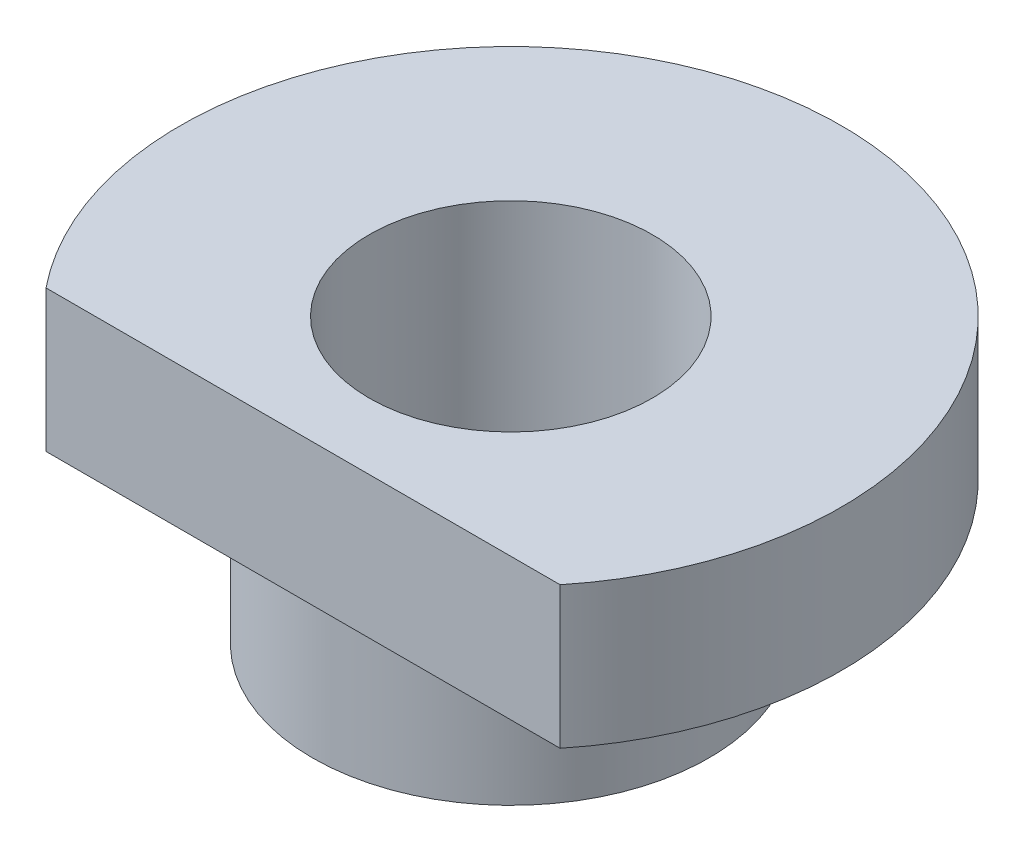
ISO-10303-21;
HEADER;
FILE_DESCRIPTION(('STEP AP214'),'2;1');
FILE_NAME('part.step','',(''),(''),'','','');
FILE_SCHEMA(('AUTOMOTIVE_DESIGN { 1 0 10303 214 1 1 1 1 }'));
ENDSEC;
DATA;
#1=APPLICATION_CONTEXT('core data for automotive mechanical design processes');
#2=APPLICATION_PROTOCOL_DEFINITION('international standard','automotive_design',2000,#1);
#3=PRODUCT_CONTEXT('',#1,'mechanical');
#4=PRODUCT('Part','Part','',(#3));
#5=PRODUCT_RELATED_PRODUCT_CATEGORY('part','',(#4));
#6=PRODUCT_DEFINITION_FORMATION('','',#4);
#7=PRODUCT_DEFINITION_CONTEXT('part definition',#1,'design');
#8=PRODUCT_DEFINITION('design','',#6,#7);
#9=PRODUCT_DEFINITION_SHAPE('','',#8);
#10=(LENGTH_UNIT() NAMED_UNIT(*) SI_UNIT(.MILLI.,.METRE.));
#11=(NAMED_UNIT(*) PLANE_ANGLE_UNIT() SI_UNIT($,.RADIAN.));
#12=(NAMED_UNIT(*) SI_UNIT($,.STERADIAN.) SOLID_ANGLE_UNIT());
#13=UNCERTAINTY_MEASURE_WITH_UNIT(LENGTH_MEASURE(1.E-05),#10,'distance_accuracy_value','');
#14=(GEOMETRIC_REPRESENTATION_CONTEXT(3) GLOBAL_UNCERTAINTY_ASSIGNED_CONTEXT((#13)) GLOBAL_UNIT_ASSIGNED_CONTEXT((#10,
#11,#12)) REPRESENTATION_CONTEXT('',''));
#15=CARTESIAN_POINT('',(0.,0.,0.));
#16=DIRECTION('',(0.,0.,1.));
#17=DIRECTION('',(1.,0.,0.));
#18=AXIS2_PLACEMENT_3D('',#15,#16,#17);
#19=CARTESIAN_POINT('',(3.5,1.5,0.));
#20=DIRECTION('',(0.,-1.,0.));
#21=DIRECTION('',(0.,0.,-1.));
#22=AXIS2_PLACEMENT_3D('',#19,#20,#21);
#23=PLANE('',#22);
#24=CARTESIAN_POINT('',(0.,1.5,0.));
#25=DIRECTION('',(0.,1.,0.));
#26=DIRECTION('',(0.,0.,1.));
#27=AXIS2_PLACEMENT_3D('',#24,#25,#26);
#28=CIRCLE('',#27,1.5);
#29=CARTESIAN_POINT('',(0.,1.5,1.5));
#30=VERTEX_POINT('',#29);
#31=EDGE_CURVE('E72',#30,#30,#28,.T.);
#32=ORIENTED_EDGE('',*,*,#31,.F.);
#33=EDGE_LOOP('',(#32));
#34=FACE_BOUND('',#33,.T.);
#35=DIRECTION('',(-1.,0.,0.));
#36=VECTOR('',#35,1.);
#37=CARTESIAN_POINT('',(3.5,1.5,2.2));
#38=LINE('',#37,#36);
#39=CARTESIAN_POINT('',(2.72213151776324,1.5,2.2));
#40=VERTEX_POINT('',#39);
#41=CARTESIAN_POINT('',(-2.72213151776324,1.5,2.2));
#42=VERTEX_POINT('',#41);
#43=EDGE_CURVE('E67',#40,#42,#38,.T.);
#44=ORIENTED_EDGE('',*,*,#43,.F.);
#45=CARTESIAN_POINT('',(0.,1.5,0.));
#46=DIRECTION('',(0.,1.,0.));
#47=DIRECTION('',(0.,0.,1.));
#48=AXIS2_PLACEMENT_3D('',#45,#46,#47);
#49=CIRCLE('',#48,3.5);
#50=EDGE_CURVE('E66',#40,#42,#49,.T.);
#51=ORIENTED_EDGE('',*,*,#50,.T.);
#52=EDGE_LOOP('',(#44,#51));
#53=FACE_BOUND('',#52,.T.);
#54=ADVANCED_FACE('F33',(#34,#53),#23,.F.);
#55=CARTESIAN_POINT('',(0.,0.,0.));
#56=DIRECTION('',(0.,1.,0.));
#57=DIRECTION('',(0.,0.,1.));
#58=AXIS2_PLACEMENT_3D('',#55,#56,#57);
#59=CYLINDRICAL_SURFACE('',#58,3.5);
#60=DIRECTION('',(0.,1.,0.));
#61=VECTOR('',#60,1.);
#62=CARTESIAN_POINT('',(2.72213151776324,0.,2.2));
#63=LINE('',#62,#61);
#64=CARTESIAN_POINT('',(2.72213151776324,0.,2.2));
#65=VERTEX_POINT('',#64);
#66=EDGE_CURVE('E52',#65,#40,#63,.T.);
#67=ORIENTED_EDGE('',*,*,#66,.F.);
#68=CARTESIAN_POINT('',(0.,0.,0.));
#69=DIRECTION('',(0.,1.,0.));
#70=DIRECTION('',(0.,0.,1.));
#71=AXIS2_PLACEMENT_3D('',#68,#69,#70);
#72=CIRCLE('',#71,3.5);
#73=CARTESIAN_POINT('',(-2.72213151776324,0.,2.2));
#74=VERTEX_POINT('',#73);
#75=EDGE_CURVE('E64',#65,#74,#72,.T.);
#76=ORIENTED_EDGE('',*,*,#75,.T.);
#77=DIRECTION('',(0.,1.,0.));
#78=VECTOR('',#77,1.);
#79=CARTESIAN_POINT('',(-2.72213151776324,0.,2.2));
#80=LINE('',#79,#78);
#81=EDGE_CURVE('E47',#42,#74,#80,.F.);
#82=ORIENTED_EDGE('',*,*,#81,.F.);
#83=ORIENTED_EDGE('',*,*,#50,.F.);
#84=EDGE_LOOP('',(#67,#76,#82,#83));
#85=FACE_BOUND('',#84,.T.);
#86=ADVANCED_FACE('F63',(#85),#59,.T.);
#87=CARTESIAN_POINT('',(2.1,0.,0.));
#88=DIRECTION('',(0.,1.,0.));
#89=DIRECTION('',(0.,0.,1.));
#90=AXIS2_PLACEMENT_3D('',#87,#88,#89);
#91=PLANE('',#90);
#92=CARTESIAN_POINT('',(0.,0.,0.));
#93=DIRECTION('',(0.,1.,0.));
#94=DIRECTION('',(0.,0.,1.));
#95=AXIS2_PLACEMENT_3D('',#92,#93,#94);
#96=CIRCLE('',#95,2.1);
#97=CARTESIAN_POINT('',(0.,0.,2.1));
#98=VERTEX_POINT('',#97);
#99=EDGE_CURVE('E70',#98,#98,#96,.T.);
#100=ORIENTED_EDGE('',*,*,#99,.T.);
#101=EDGE_LOOP('',(#100));
#102=FACE_BOUND('',#101,.T.);
#103=DIRECTION('',(1.,0.,0.));
#104=VECTOR('',#103,1.);
#105=CARTESIAN_POINT('',(2.1,0.,2.2));
#106=LINE('',#105,#104);
#107=EDGE_CURVE('E11',#74,#65,#106,.T.);
#108=ORIENTED_EDGE('',*,*,#107,.F.);
#109=ORIENTED_EDGE('',*,*,#75,.F.);
#110=EDGE_LOOP('',(#108,#109));
#111=FACE_BOUND('',#110,.T.);
#112=ADVANCED_FACE('F69',(#102,#111),#91,.F.);
#113=CARTESIAN_POINT('',(0.,0.,0.));
#114=DIRECTION('',(0.,1.,0.));
#115=DIRECTION('',(0.,0.,1.));
#116=AXIS2_PLACEMENT_3D('',#113,#114,#115);
#117=CYLINDRICAL_SURFACE('',#116,2.1);
#118=ORIENTED_EDGE('',*,*,#99,.F.);
#119=EDGE_LOOP('',(#118));
#120=FACE_BOUND('',#119,.T.);
#121=CARTESIAN_POINT('',(0.,-1.5,0.));
#122=DIRECTION('',(0.,1.,0.));
#123=DIRECTION('',(0.,0.,1.));
#124=AXIS2_PLACEMENT_3D('',#121,#122,#123);
#125=CIRCLE('',#124,2.1);
#126=CARTESIAN_POINT('',(0.,-1.5,2.1));
#127=VERTEX_POINT('',#126);
#128=EDGE_CURVE('E41',#127,#127,#125,.T.);
#129=ORIENTED_EDGE('',*,*,#128,.T.);
#130=EDGE_LOOP('',(#129));
#131=FACE_BOUND('',#130,.T.);
#132=ADVANCED_FACE('F35',(#120,#131),#117,.T.);
#133=CARTESIAN_POINT('',(1.5,-1.5,0.));
#134=DIRECTION('',(0.,1.,0.));
#135=DIRECTION('',(0.,0.,1.));
#136=AXIS2_PLACEMENT_3D('',#133,#134,#135);
#137=PLANE('',#136);
#138=ORIENTED_EDGE('',*,*,#128,.F.);
#139=EDGE_LOOP('',(#138));
#140=FACE_BOUND('',#139,.T.);
#141=CARTESIAN_POINT('',(0.,-1.5,0.));
#142=DIRECTION('',(0.,1.,0.));
#143=DIRECTION('',(0.,0.,1.));
#144=AXIS2_PLACEMENT_3D('',#141,#142,#143);
#145=CIRCLE('',#144,1.5);
#146=CARTESIAN_POINT('',(0.,-1.5,1.5));
#147=VERTEX_POINT('',#146);
#148=EDGE_CURVE('E80',#147,#147,#145,.T.);
#149=ORIENTED_EDGE('',*,*,#148,.T.);
#150=EDGE_LOOP('',(#149));
#151=FACE_BOUND('',#150,.T.);
#152=ADVANCED_FACE('F86',(#140,#151),#137,.F.);
#153=CARTESIAN_POINT('',(0.,0.,0.));
#154=DIRECTION('',(0.,1.,0.));
#155=DIRECTION('',(0.,0.,1.));
#156=AXIS2_PLACEMENT_3D('',#153,#154,#155);
#157=CYLINDRICAL_SURFACE('',#156,1.5);
#158=ORIENTED_EDGE('',*,*,#148,.F.);
#159=EDGE_LOOP('',(#158));
#160=FACE_BOUND('',#159,.T.);
#161=ORIENTED_EDGE('',*,*,#31,.T.);
#162=EDGE_LOOP('',(#161));
#163=FACE_BOUND('',#162,.T.);
#164=ADVANCED_FACE('F89',(#160,#163),#157,.F.);
#165=CARTESIAN_POINT('',(0.,0.,2.2));
#166=DIRECTION('',(0.,0.,1.));
#167=DIRECTION('',(1.,0.,0.));
#168=AXIS2_PLACEMENT_3D('',#165,#166,#167);
#169=PLANE('',#168);
#170=ORIENTED_EDGE('',*,*,#43,.T.);
#171=ORIENTED_EDGE('',*,*,#81,.T.);
#172=ORIENTED_EDGE('',*,*,#107,.T.);
#173=ORIENTED_EDGE('',*,*,#66,.T.);
#174=EDGE_LOOP('',(#170,#171,#172,#173));
#175=FACE_BOUND('',#174,.T.);
#176=ADVANCED_FACE('F57',(#175),#169,.T.);
#177=CLOSED_SHELL('',(#54,#86,#112,#132,#152,#164,#176));
#178=MANIFOLD_SOLID_BREP('B2',#177);
#179=ADVANCED_BREP_SHAPE_REPRESENTATION('',(#18,#178),#14);
#180=SHAPE_DEFINITION_REPRESENTATION(#9,#179);
ENDSEC;
END-ISO-10303-21;
